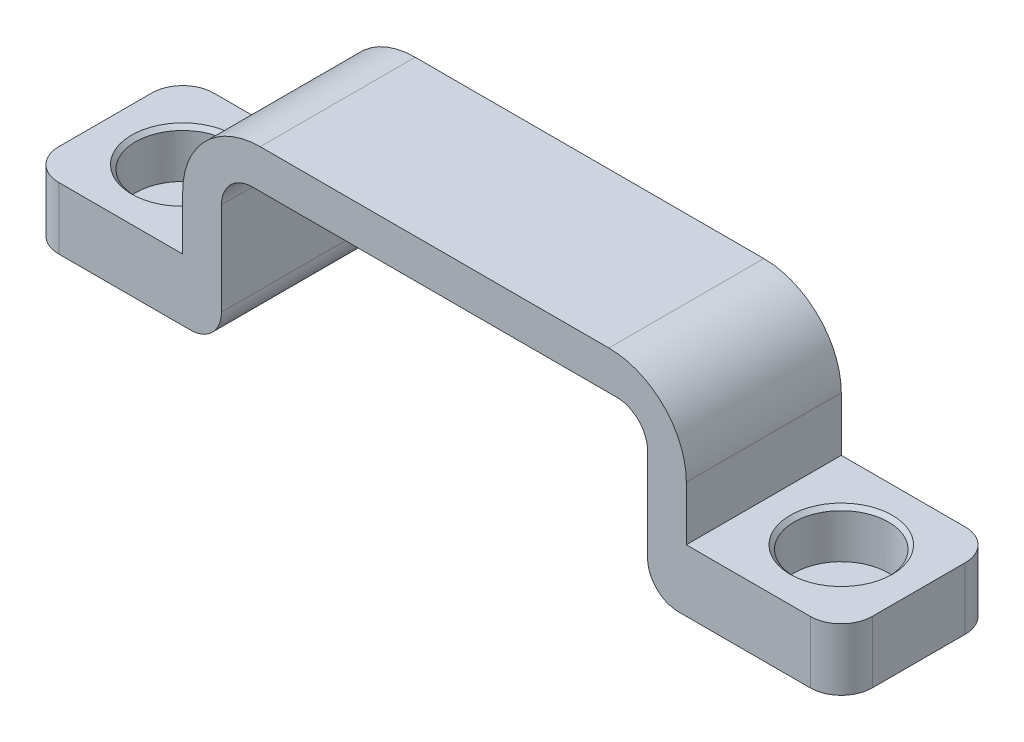
ISO-10303-21;
HEADER;
FILE_DESCRIPTION(('STEP AP214'),'2;1');
FILE_NAME('part.step','',(''),(''),'','','');
FILE_SCHEMA(('AUTOMOTIVE_DESIGN { 1 0 10303 214 1 1 1 1 }'));
ENDSEC;
DATA;
#1=APPLICATION_CONTEXT('core data for automotive mechanical design processes');
#2=APPLICATION_PROTOCOL_DEFINITION('international standard','automotive_design',2000,#1);
#3=PRODUCT_CONTEXT('',#1,'mechanical');
#4=PRODUCT('Part','Part','',(#3));
#5=PRODUCT_RELATED_PRODUCT_CATEGORY('part','',(#4));
#6=PRODUCT_DEFINITION_FORMATION('','',#4);
#7=PRODUCT_DEFINITION_CONTEXT('part definition',#1,'design');
#8=PRODUCT_DEFINITION('design','',#6,#7);
#9=PRODUCT_DEFINITION_SHAPE('','',#8);
#10=(LENGTH_UNIT() NAMED_UNIT(*) SI_UNIT(.MILLI.,.METRE.));
#11=(NAMED_UNIT(*) PLANE_ANGLE_UNIT() SI_UNIT($,.RADIAN.));
#12=(NAMED_UNIT(*) SI_UNIT($,.STERADIAN.) SOLID_ANGLE_UNIT());
#13=UNCERTAINTY_MEASURE_WITH_UNIT(LENGTH_MEASURE(1.E-05),#10,'distance_accuracy_value','');
#14=(GEOMETRIC_REPRESENTATION_CONTEXT(3) GLOBAL_UNCERTAINTY_ASSIGNED_CONTEXT((#13)) GLOBAL_UNIT_ASSIGNED_CONTEXT((#10,
#11,#12)) REPRESENTATION_CONTEXT('',''));
#15=CARTESIAN_POINT('',(0.,0.,0.));
#16=DIRECTION('',(0.,0.,1.));
#17=DIRECTION('',(1.,0.,0.));
#18=AXIS2_PLACEMENT_3D('',#15,#16,#17);
#19=CARTESIAN_POINT('',(16.25,2.5,5.));
#20=DIRECTION('',(-1.,0.,0.));
#21=DIRECTION('',(0.,0.,1.));
#22=AXIS2_PLACEMENT_3D('',#19,#20,#21);
#23=PLANE('',#22);
#24=DIRECTION('',(0.,1.,0.));
#25=VECTOR('',#24,1.);
#26=CARTESIAN_POINT('',(16.25,2.5,-5.));
#27=LINE('',#26,#25);
#28=CARTESIAN_POINT('',(16.25,-6.,-5.));
#29=VERTEX_POINT('',#28);
#30=CARTESIAN_POINT('',(16.25,-2.5,-5.));
#31=VERTEX_POINT('',#30);
#32=EDGE_CURVE('E257',#29,#31,#27,.T.);
#33=ORIENTED_EDGE('',*,*,#32,.T.);
#34=DIRECTION('',(0.,0.,-1.));
#35=VECTOR('',#34,1.);
#36=CARTESIAN_POINT('',(16.25,-2.5,5.));
#37=LINE('',#36,#35);
#38=CARTESIAN_POINT('',(16.25,-2.5,5.));
#39=VERTEX_POINT('',#38);
#40=EDGE_CURVE('E358',#31,#39,#37,.F.);
#41=ORIENTED_EDGE('',*,*,#40,.T.);
#42=DIRECTION('',(0.,1.,0.));
#43=VECTOR('',#42,1.);
#44=CARTESIAN_POINT('',(16.25,2.5,5.));
#45=LINE('',#44,#43);
#46=CARTESIAN_POINT('',(16.25,-6.,5.));
#47=VERTEX_POINT('',#46);
#48=EDGE_CURVE('E291',#47,#39,#45,.T.);
#49=ORIENTED_EDGE('',*,*,#48,.F.);
#50=DIRECTION('',(0.,0.,-1.));
#51=VECTOR('',#50,1.);
#52=CARTESIAN_POINT('',(16.25,-6.,5.));
#53=LINE('',#52,#51);
#54=EDGE_CURVE('E256',#47,#29,#53,.T.);
#55=ORIENTED_EDGE('',*,*,#54,.T.);
#56=EDGE_LOOP('',(#33,#41,#49,#55));
#57=FACE_BOUND('',#56,.T.);
#58=ADVANCED_FACE('F47',(#57),#23,.F.);
#59=CARTESIAN_POINT('',(-16.25,2.5,5.));
#60=DIRECTION('',(0.,-1.,0.));
#61=DIRECTION('',(0.,0.,-1.));
#62=AXIS2_PLACEMENT_3D('',#59,#60,#61);
#63=PLANE('',#62);
#64=DIRECTION('',(-1.,0.,0.));
#65=VECTOR('',#64,1.);
#66=CARTESIAN_POINT('',(-16.25,2.5,-5.));
#67=LINE('',#66,#65);
#68=CARTESIAN_POINT('',(11.25,2.5,-5.));
#69=VERTEX_POINT('',#68);
#70=CARTESIAN_POINT('',(-11.25,2.5,-5.));
#71=VERTEX_POINT('',#70);
#72=EDGE_CURVE('E261',#69,#71,#67,.T.);
#73=ORIENTED_EDGE('',*,*,#72,.T.);
#74=DIRECTION('',(0.,0.,-1.));
#75=VECTOR('',#74,1.);
#76=CARTESIAN_POINT('',(-11.25,2.5,5.));
#77=LINE('',#76,#75);
#78=CARTESIAN_POINT('',(-11.25,2.5,5.));
#79=VERTEX_POINT('',#78);
#80=EDGE_CURVE('E350',#71,#79,#77,.F.);
#81=ORIENTED_EDGE('',*,*,#80,.T.);
#82=DIRECTION('',(-1.,0.,0.));
#83=VECTOR('',#82,1.);
#84=CARTESIAN_POINT('',(-16.25,2.5,5.));
#85=LINE('',#84,#83);
#86=CARTESIAN_POINT('',(11.25,2.5,5.));
#87=VERTEX_POINT('',#86);
#88=EDGE_CURVE('E214',#87,#79,#85,.T.);
#89=ORIENTED_EDGE('',*,*,#88,.F.);
#90=DIRECTION('',(0.,0.,-1.));
#91=VECTOR('',#90,1.);
#92=CARTESIAN_POINT('',(11.25,2.5,5.));
#93=LINE('',#92,#91);
#94=EDGE_CURVE('E346',#87,#69,#93,.T.);
#95=ORIENTED_EDGE('',*,*,#94,.T.);
#96=EDGE_LOOP('',(#73,#81,#89,#95));
#97=FACE_BOUND('',#96,.T.);
#98=ADVANCED_FACE('F462',(#97),#63,.F.);
#99=CARTESIAN_POINT('',(-16.25,2.5,5.));
#100=DIRECTION('',(1.,0.,0.));
#101=DIRECTION('',(0.,0.,-1.));
#102=AXIS2_PLACEMENT_3D('',#99,#100,#101);
#103=PLANE('',#102);
#104=DIRECTION('',(0.,-1.,0.));
#105=VECTOR('',#104,1.);
#106=CARTESIAN_POINT('',(-16.25,2.5,5.));
#107=LINE('',#106,#105);
#108=CARTESIAN_POINT('',(-16.25,-2.5,5.));
#109=VERTEX_POINT('',#108);
#110=CARTESIAN_POINT('',(-16.25,-6.,5.));
#111=VERTEX_POINT('',#110);
#112=EDGE_CURVE('E199',#109,#111,#107,.T.);
#113=ORIENTED_EDGE('',*,*,#112,.F.);
#114=DIRECTION('',(0.,0.,-1.));
#115=VECTOR('',#114,1.);
#116=CARTESIAN_POINT('',(-16.25,-2.5,5.));
#117=LINE('',#116,#115);
#118=CARTESIAN_POINT('',(-16.25,-2.5,-5.));
#119=VERTEX_POINT('',#118);
#120=EDGE_CURVE('E337',#109,#119,#117,.T.);
#121=ORIENTED_EDGE('',*,*,#120,.T.);
#122=DIRECTION('',(0.,-1.,0.));
#123=VECTOR('',#122,1.);
#124=CARTESIAN_POINT('',(-16.25,2.5,-5.));
#125=LINE('',#124,#123);
#126=CARTESIAN_POINT('',(-16.25,-6.,-5.));
#127=VERTEX_POINT('',#126);
#128=EDGE_CURVE('E220',#119,#127,#125,.T.);
#129=ORIENTED_EDGE('',*,*,#128,.T.);
#130=DIRECTION('',(0.,0.,-1.));
#131=VECTOR('',#130,1.);
#132=CARTESIAN_POINT('',(-16.25,-6.,5.));
#133=LINE('',#132,#131);
#134=EDGE_CURVE('E217',#111,#127,#133,.T.);
#135=ORIENTED_EDGE('',*,*,#134,.F.);
#136=EDGE_LOOP('',(#113,#121,#129,#135));
#137=FACE_BOUND('',#136,.T.);
#138=ADVANCED_FACE('F218',(#137),#103,.F.);
#139=CARTESIAN_POINT('',(-16.25,-6.,5.));
#140=DIRECTION('',(0.,-1.,0.));
#141=DIRECTION('',(1.,0.,0.));
#142=AXIS2_PLACEMENT_3D('',#139,#140,#141);
#143=PLANE('',#142);
#144=CARTESIAN_POINT('',(-21.25,-6.,0.));
#145=DIRECTION('',(0.,-1.,0.));
#146=DIRECTION('',(1.,0.,0.));
#147=AXIS2_PLACEMENT_3D('',#144,#145,#146);
#148=CIRCLE('',#147,3.30000000000004);
#149=CARTESIAN_POINT('',(-17.95,-6.,0.));
#150=VERTEX_POINT('',#149);
#151=EDGE_CURVE('E441',#150,#150,#148,.T.);
#152=ORIENTED_EDGE('',*,*,#151,.T.);
#153=EDGE_LOOP('',(#152));
#154=FACE_BOUND('',#153,.T.);
#155=DIRECTION('',(-1.,0.,0.));
#156=VECTOR('',#155,1.);
#157=CARTESIAN_POINT('',(-16.25,-6.,-5.));
#158=LINE('',#157,#156);
#159=CARTESIAN_POINT('',(-24.25,-6.,-5.));
#160=VERTEX_POINT('',#159);
#161=EDGE_CURVE('E268',#127,#160,#158,.T.);
#162=ORIENTED_EDGE('',*,*,#161,.T.);
#163=CARTESIAN_POINT('',(-24.25,-6.,-3.));
#164=DIRECTION('',(0.,-1.,0.));
#165=DIRECTION('',(1.,0.,0.));
#166=AXIS2_PLACEMENT_3D('',#163,#164,#165);
#167=CIRCLE('',#166,2.);
#168=CARTESIAN_POINT('',(-26.25,-6.,-3.));
#169=VERTEX_POINT('',#168);
#170=EDGE_CURVE('E383',#160,#169,#167,.F.);
#171=ORIENTED_EDGE('',*,*,#170,.T.);
#172=DIRECTION('',(0.,0.,-1.));
#173=VECTOR('',#172,1.);
#174=CARTESIAN_POINT('',(-26.25,-6.,5.));
#175=LINE('',#174,#173);
#176=CARTESIAN_POINT('',(-26.25,-6.,3.));
#177=VERTEX_POINT('',#176);
#178=EDGE_CURVE('E226',#177,#169,#175,.T.);
#179=ORIENTED_EDGE('',*,*,#178,.F.);
#180=CARTESIAN_POINT('',(-24.25,-6.,3.));
#181=DIRECTION('',(0.,-1.,0.));
#182=DIRECTION('',(1.,0.,0.));
#183=AXIS2_PLACEMENT_3D('',#180,#181,#182);
#184=CIRCLE('',#183,2.);
#185=CARTESIAN_POINT('',(-24.25,-6.,5.));
#186=VERTEX_POINT('',#185);
#187=EDGE_CURVE('E231',#177,#186,#184,.F.);
#188=ORIENTED_EDGE('',*,*,#187,.T.);
#189=DIRECTION('',(-1.,0.,0.));
#190=VECTOR('',#189,1.);
#191=CARTESIAN_POINT('',(-16.25,-6.,5.));
#192=LINE('',#191,#190);
#193=EDGE_CURVE('E205',#111,#186,#192,.T.);
#194=ORIENTED_EDGE('',*,*,#193,.F.);
#195=ORIENTED_EDGE('',*,*,#134,.T.);
#196=EDGE_LOOP('',(#162,#171,#179,#188,#194,#195));
#197=FACE_BOUND('',#196,.T.);
#198=ADVANCED_FACE('F228',(#154,#197),#143,.F.);
#199=CARTESIAN_POINT('',(-26.25,-6.,5.));
#200=DIRECTION('',(1.,0.,0.));
#201=DIRECTION('',(0.,0.,-1.));
#202=AXIS2_PLACEMENT_3D('',#199,#200,#201);
#203=PLANE('',#202);
#204=ORIENTED_EDGE('',*,*,#178,.T.);
#205=DIRECTION('',(0.,-1.,0.));
#206=VECTOR('',#205,1.);
#207=CARTESIAN_POINT('',(-26.25,-6.,-3.));
#208=LINE('',#207,#206);
#209=CARTESIAN_POINT('',(-26.25,-10.,-3.));
#210=VERTEX_POINT('',#209);
#211=EDGE_CURVE('E364',#169,#210,#208,.T.);
#212=ORIENTED_EDGE('',*,*,#211,.T.);
#213=DIRECTION('',(0.,0.,-1.));
#214=VECTOR('',#213,1.);
#215=CARTESIAN_POINT('',(-26.25,-10.,5.));
#216=LINE('',#215,#214);
#217=CARTESIAN_POINT('',(-26.25,-10.,3.));
#218=VERTEX_POINT('',#217);
#219=EDGE_CURVE('E303',#218,#210,#216,.T.);
#220=ORIENTED_EDGE('',*,*,#219,.F.);
#221=DIRECTION('',(0.,-1.,0.));
#222=VECTOR('',#221,1.);
#223=CARTESIAN_POINT('',(-26.25,-6.,3.));
#224=LINE('',#223,#222);
#225=EDGE_CURVE('E361',#218,#177,#224,.F.);
#226=ORIENTED_EDGE('',*,*,#225,.T.);
#227=EDGE_LOOP('',(#204,#212,#220,#226));
#228=FACE_BOUND('',#227,.T.);
#229=ADVANCED_FACE('F600',(#228),#203,.F.);
#230=CARTESIAN_POINT('',(-16.25,-10.,5.));
#231=DIRECTION('',(0.,1.,0.));
#232=DIRECTION('',(-1.,0.,0.));
#233=AXIS2_PLACEMENT_3D('',#230,#231,#232);
#234=PLANE('',#233);
#235=DIRECTION('',(1.,0.,0.));
#236=VECTOR('',#235,1.);
#237=CARTESIAN_POINT('',(-16.25,-10.,-5.));
#238=LINE('',#237,#236);
#239=CARTESIAN_POINT('',(-24.25,-9.99999999999999,-5.));
#240=VERTEX_POINT('',#239);
#241=CARTESIAN_POINT('',(-15.75,-10.,-5.));
#242=VERTEX_POINT('',#241);
#243=EDGE_CURVE('E271',#240,#242,#238,.T.);
#244=ORIENTED_EDGE('',*,*,#243,.T.);
#245=DIRECTION('',(0.,0.,-1.));
#246=VECTOR('',#245,1.);
#247=CARTESIAN_POINT('',(-15.75,-10.,5.));
#248=LINE('',#247,#246);
#249=CARTESIAN_POINT('',(-15.75,-10.,5.));
#250=VERTEX_POINT('',#249);
#251=EDGE_CURVE('E423',#242,#250,#248,.F.);
#252=ORIENTED_EDGE('',*,*,#251,.T.);
#253=DIRECTION('',(1.,0.,0.));
#254=VECTOR('',#253,1.);
#255=CARTESIAN_POINT('',(-16.25,-10.,5.));
#256=LINE('',#255,#254);
#257=CARTESIAN_POINT('',(-24.25,-10.,5.));
#258=VERTEX_POINT('',#257);
#259=EDGE_CURVE('E233',#258,#250,#256,.T.);
#260=ORIENTED_EDGE('',*,*,#259,.F.);
#261=CARTESIAN_POINT('',(-24.25,-9.99999999999999,3.));
#262=DIRECTION('',(0.,1.,0.));
#263=DIRECTION('',(-1.,0.,0.));
#264=AXIS2_PLACEMENT_3D('',#261,#262,#263);
#265=CIRCLE('',#264,2.);
#266=EDGE_CURVE('E368',#258,#218,#265,.F.);
#267=ORIENTED_EDGE('',*,*,#266,.T.);
#268=ORIENTED_EDGE('',*,*,#219,.T.);
#269=CARTESIAN_POINT('',(-24.25,-9.99999999999999,-3.));
#270=DIRECTION('',(0.,1.,0.));
#271=DIRECTION('',(-1.,0.,0.));
#272=AXIS2_PLACEMENT_3D('',#269,#270,#271);
#273=CIRCLE('',#272,2.);
#274=EDGE_CURVE('E371',#210,#240,#273,.F.);
#275=ORIENTED_EDGE('',*,*,#274,.T.);
#276=EDGE_LOOP('',(#244,#252,#260,#267,#268,#275));
#277=FACE_BOUND('',#276,.T.);
#278=ADVANCED_FACE('F596',(#277),#234,.F.);
#279=CARTESIAN_POINT('',(-13.75,-10.,5.));
#280=DIRECTION('',(-1.,0.,0.));
#281=DIRECTION('',(0.,0.,1.));
#282=AXIS2_PLACEMENT_3D('',#279,#280,#281);
#283=PLANE('',#282);
#284=DIRECTION('',(0.,1.,0.));
#285=VECTOR('',#284,1.);
#286=CARTESIAN_POINT('',(-13.75,-10.,5.));
#287=LINE('',#286,#285);
#288=CARTESIAN_POINT('',(-13.75,-8.,5.));
#289=VERTEX_POINT('',#288);
#290=CARTESIAN_POINT('',(-13.75,-2.,5.));
#291=VERTEX_POINT('',#290);
#292=EDGE_CURVE('E237',#289,#291,#287,.T.);
#293=ORIENTED_EDGE('',*,*,#292,.F.);
#294=DIRECTION('',(0.,0.,-1.));
#295=VECTOR('',#294,1.);
#296=CARTESIAN_POINT('',(-13.75,-8.,5.));
#297=LINE('',#296,#295);
#298=CARTESIAN_POINT('',(-13.75,-8.,-5.));
#299=VERTEX_POINT('',#298);
#300=EDGE_CURVE('E413',#289,#299,#297,.T.);
#301=ORIENTED_EDGE('',*,*,#300,.T.);
#302=DIRECTION('',(0.,1.,0.));
#303=VECTOR('',#302,1.);
#304=CARTESIAN_POINT('',(-13.75,-10.,-5.));
#305=LINE('',#304,#303);
#306=CARTESIAN_POINT('',(-13.75,-2.,-5.));
#307=VERTEX_POINT('',#306);
#308=EDGE_CURVE('E275',#299,#307,#305,.T.);
#309=ORIENTED_EDGE('',*,*,#308,.T.);
#310=DIRECTION('',(0.,0.,-1.));
#311=VECTOR('',#310,1.);
#312=CARTESIAN_POINT('',(-13.75,-2.,5.));
#313=LINE('',#312,#311);
#314=EDGE_CURVE('E316',#307,#291,#313,.F.);
#315=ORIENTED_EDGE('',*,*,#314,.T.);
#316=EDGE_LOOP('',(#293,#301,#309,#315));
#317=FACE_BOUND('',#316,.T.);
#318=ADVANCED_FACE('F592',(#317),#283,.F.);
#319=CARTESIAN_POINT('',(-13.75,0.,5.));
#320=DIRECTION('',(0.,1.,0.));
#321=DIRECTION('',(0.,0.,1.));
#322=AXIS2_PLACEMENT_3D('',#319,#320,#321);
#323=PLANE('',#322);
#324=DIRECTION('',(1.,0.,0.));
#325=VECTOR('',#324,1.);
#326=CARTESIAN_POINT('',(-13.75,0.,5.));
#327=LINE('',#326,#325);
#328=CARTESIAN_POINT('',(-11.75,0.,5.));
#329=VERTEX_POINT('',#328);
#330=CARTESIAN_POINT('',(11.75,0.,5.));
#331=VERTEX_POINT('',#330);
#332=EDGE_CURVE('E243',#329,#331,#327,.T.);
#333=ORIENTED_EDGE('',*,*,#332,.F.);
#334=DIRECTION('',(0.,0.,-1.));
#335=VECTOR('',#334,1.);
#336=CARTESIAN_POINT('',(-11.75,0.,-5.));
#337=LINE('',#336,#335);
#338=CARTESIAN_POINT('',(-11.75,0.,-5.));
#339=VERTEX_POINT('',#338);
#340=EDGE_CURVE('E312',#329,#339,#337,.T.);
#341=ORIENTED_EDGE('',*,*,#340,.T.);
#342=DIRECTION('',(1.,0.,0.));
#343=VECTOR('',#342,1.);
#344=CARTESIAN_POINT('',(-13.75,0.,-5.));
#345=LINE('',#344,#343);
#346=CARTESIAN_POINT('',(11.75,0.,-5.));
#347=VERTEX_POINT('',#346);
#348=EDGE_CURVE('E278',#339,#347,#345,.T.);
#349=ORIENTED_EDGE('',*,*,#348,.T.);
#350=DIRECTION('',(0.,0.,-1.));
#351=VECTOR('',#350,1.);
#352=CARTESIAN_POINT('',(11.75,0.,5.));
#353=LINE('',#352,#351);
#354=EDGE_CURVE('E225',#347,#331,#353,.F.);
#355=ORIENTED_EDGE('',*,*,#354,.T.);
#356=EDGE_LOOP('',(#333,#341,#349,#355));
#357=FACE_BOUND('',#356,.T.);
#358=ADVANCED_FACE('F589',(#357),#323,.F.);
#359=CARTESIAN_POINT('',(13.75,-10.,5.));
#360=DIRECTION('',(1.,0.,0.));
#361=DIRECTION('',(0.,0.,-1.));
#362=AXIS2_PLACEMENT_3D('',#359,#360,#361);
#363=PLANE('',#362);
#364=DIRECTION('',(0.,-1.,0.));
#365=VECTOR('',#364,1.);
#366=CARTESIAN_POINT('',(13.75,-10.,-5.));
#367=LINE('',#366,#365);
#368=CARTESIAN_POINT('',(13.75,-2.,-5.));
#369=VERTEX_POINT('',#368);
#370=CARTESIAN_POINT('',(13.75,-8.,-5.));
#371=VERTEX_POINT('',#370);
#372=EDGE_CURVE('E282',#369,#371,#367,.T.);
#373=ORIENTED_EDGE('',*,*,#372,.T.);
#374=DIRECTION('',(0.,0.,-1.));
#375=VECTOR('',#374,1.);
#376=CARTESIAN_POINT('',(13.75,-8.,5.));
#377=LINE('',#376,#375);
#378=CARTESIAN_POINT('',(13.75,-8.,5.));
#379=VERTEX_POINT('',#378);
#380=EDGE_CURVE('E72',#371,#379,#377,.F.);
#381=ORIENTED_EDGE('',*,*,#380,.T.);
#382=DIRECTION('',(0.,-1.,0.));
#383=VECTOR('',#382,1.);
#384=CARTESIAN_POINT('',(13.75,-10.,5.));
#385=LINE('',#384,#383);
#386=CARTESIAN_POINT('',(13.75,-2.,5.));
#387=VERTEX_POINT('',#386);
#388=EDGE_CURVE('E247',#387,#379,#385,.T.);
#389=ORIENTED_EDGE('',*,*,#388,.F.);
#390=DIRECTION('',(0.,0.,-1.));
#391=VECTOR('',#390,1.);
#392=CARTESIAN_POINT('',(13.75,-2.,-5.));
#393=LINE('',#392,#391);
#394=EDGE_CURVE('E320',#387,#369,#393,.T.);
#395=ORIENTED_EDGE('',*,*,#394,.T.);
#396=EDGE_LOOP('',(#373,#381,#389,#395));
#397=FACE_BOUND('',#396,.T.);
#398=ADVANCED_FACE('F586',(#397),#363,.F.);
#399=CARTESIAN_POINT('',(16.25,-10.,5.));
#400=DIRECTION('',(0.,1.,0.));
#401=DIRECTION('',(-1.,0.,0.));
#402=AXIS2_PLACEMENT_3D('',#399,#400,#401);
#403=PLANE('',#402);
#404=DIRECTION('',(1.,0.,0.));
#405=VECTOR('',#404,1.);
#406=CARTESIAN_POINT('',(16.25,-10.,5.));
#407=LINE('',#406,#405);
#408=CARTESIAN_POINT('',(15.75,-10.,5.));
#409=VERTEX_POINT('',#408);
#410=CARTESIAN_POINT('',(24.25,-9.99999999999999,5.));
#411=VERTEX_POINT('',#410);
#412=EDGE_CURVE('E250',#409,#411,#407,.T.);
#413=ORIENTED_EDGE('',*,*,#412,.F.);
#414=DIRECTION('',(0.,0.,-1.));
#415=VECTOR('',#414,1.);
#416=CARTESIAN_POINT('',(15.75,-10.,5.));
#417=LINE('',#416,#415);
#418=CARTESIAN_POINT('',(15.75,-10.,-5.));
#419=VERTEX_POINT('',#418);
#420=EDGE_CURVE('E431',#409,#419,#417,.T.);
#421=ORIENTED_EDGE('',*,*,#420,.T.);
#422=DIRECTION('',(1.,0.,0.));
#423=VECTOR('',#422,1.);
#424=CARTESIAN_POINT('',(16.25,-10.,-5.));
#425=LINE('',#424,#423);
#426=CARTESIAN_POINT('',(24.25,-10.,-5.));
#427=VERTEX_POINT('',#426);
#428=EDGE_CURVE('E285',#419,#427,#425,.T.);
#429=ORIENTED_EDGE('',*,*,#428,.T.);
#430=CARTESIAN_POINT('',(24.25,-10.,-3.));
#431=DIRECTION('',(0.,1.,0.));
#432=DIRECTION('',(-1.,0.,0.));
#433=AXIS2_PLACEMENT_3D('',#430,#431,#432);
#434=CIRCLE('',#433,2.);
#435=CARTESIAN_POINT('',(26.25,-10.,-3.));
#436=VERTEX_POINT('',#435);
#437=EDGE_CURVE('E410',#427,#436,#434,.F.);
#438=ORIENTED_EDGE('',*,*,#437,.T.);
#439=DIRECTION('',(0.,0.,-1.));
#440=VECTOR('',#439,1.);
#441=CARTESIAN_POINT('',(26.25,-10.,5.));
#442=LINE('',#441,#440);
#443=CARTESIAN_POINT('',(26.25,-10.,3.));
#444=VERTEX_POINT('',#443);
#445=EDGE_CURVE('E299',#444,#436,#442,.T.);
#446=ORIENTED_EDGE('',*,*,#445,.F.);
#447=CARTESIAN_POINT('',(24.25,-10.,3.));
#448=DIRECTION('',(0.,1.,0.));
#449=DIRECTION('',(-1.,0.,0.));
#450=AXIS2_PLACEMENT_3D('',#447,#448,#449);
#451=CIRCLE('',#450,2.);
#452=EDGE_CURVE('E406',#444,#411,#451,.F.);
#453=ORIENTED_EDGE('',*,*,#452,.T.);
#454=EDGE_LOOP('',(#413,#421,#429,#438,#446,#453));
#455=FACE_BOUND('',#454,.T.);
#456=ADVANCED_FACE('F526',(#455),#403,.F.);
#457=CARTESIAN_POINT('',(26.25,-6.,5.));
#458=DIRECTION('',(-1.,0.,0.));
#459=DIRECTION('',(0.,0.,1.));
#460=AXIS2_PLACEMENT_3D('',#457,#458,#459);
#461=PLANE('',#460);
#462=ORIENTED_EDGE('',*,*,#445,.T.);
#463=DIRECTION('',(0.,1.,0.));
#464=VECTOR('',#463,1.);
#465=CARTESIAN_POINT('',(26.25,-6.,-3.));
#466=LINE('',#465,#464);
#467=CARTESIAN_POINT('',(26.25,-6.,-3.));
#468=VERTEX_POINT('',#467);
#469=EDGE_CURVE('E396',#436,#468,#466,.T.);
#470=ORIENTED_EDGE('',*,*,#469,.T.);
#471=DIRECTION('',(0.,0.,-1.));
#472=VECTOR('',#471,1.);
#473=CARTESIAN_POINT('',(26.25,-6.,5.));
#474=LINE('',#473,#472);
#475=CARTESIAN_POINT('',(26.25,-6.,3.));
#476=VERTEX_POINT('',#475);
#477=EDGE_CURVE('E295',#476,#468,#474,.T.);
#478=ORIENTED_EDGE('',*,*,#477,.F.);
#479=DIRECTION('',(0.,1.,0.));
#480=VECTOR('',#479,1.);
#481=CARTESIAN_POINT('',(26.25,-10.,3.));
#482=LINE('',#481,#480);
#483=EDGE_CURVE('E393',#476,#444,#482,.F.);
#484=ORIENTED_EDGE('',*,*,#483,.T.);
#485=EDGE_LOOP('',(#462,#470,#478,#484));
#486=FACE_BOUND('',#485,.T.);
#487=ADVANCED_FACE('F538',(#486),#461,.F.);
#488=CARTESIAN_POINT('',(16.25,-6.,5.));
#489=DIRECTION('',(0.,-1.,0.));
#490=DIRECTION('',(1.,0.,0.));
#491=AXIS2_PLACEMENT_3D('',#488,#489,#490);
#492=PLANE('',#491);
#493=CARTESIAN_POINT('',(21.25,-6.,0.));
#494=DIRECTION('',(0.,-1.,0.));
#495=DIRECTION('',(1.,0.,0.));
#496=AXIS2_PLACEMENT_3D('',#493,#494,#495);
#497=CIRCLE('',#496,3.30000000000003);
#498=CARTESIAN_POINT('',(24.55,-6.,0.));
#499=VERTEX_POINT('',#498);
#500=EDGE_CURVE('E12',#499,#499,#497,.T.);
#501=ORIENTED_EDGE('',*,*,#500,.T.);
#502=EDGE_LOOP('',(#501));
#503=FACE_BOUND('',#502,.T.);
#504=ORIENTED_EDGE('',*,*,#477,.T.);
#505=CARTESIAN_POINT('',(24.25,-6.,-3.));
#506=DIRECTION('',(0.,-1.,0.));
#507=DIRECTION('',(1.,0.,0.));
#508=AXIS2_PLACEMENT_3D('',#505,#506,#507);
#509=CIRCLE('',#508,2.);
#510=CARTESIAN_POINT('',(24.25,-6.,-5.));
#511=VERTEX_POINT('',#510);
#512=EDGE_CURVE('E403',#468,#511,#509,.F.);
#513=ORIENTED_EDGE('',*,*,#512,.T.);
#514=DIRECTION('',(-1.,0.,0.));
#515=VECTOR('',#514,1.);
#516=CARTESIAN_POINT('',(16.25,-6.,-5.));
#517=LINE('',#516,#515);
#518=EDGE_CURVE('E288',#511,#29,#517,.T.);
#519=ORIENTED_EDGE('',*,*,#518,.T.);
#520=ORIENTED_EDGE('',*,*,#54,.F.);
#521=DIRECTION('',(-1.,0.,0.));
#522=VECTOR('',#521,1.);
#523=CARTESIAN_POINT('',(16.25,-6.,5.));
#524=LINE('',#523,#522);
#525=CARTESIAN_POINT('',(24.25,-6.,5.));
#526=VERTEX_POINT('',#525);
#527=EDGE_CURVE('E253',#526,#47,#524,.T.);
#528=ORIENTED_EDGE('',*,*,#527,.F.);
#529=CARTESIAN_POINT('',(24.25,-6.,3.));
#530=DIRECTION('',(0.,-1.,0.));
#531=DIRECTION('',(1.,0.,0.));
#532=AXIS2_PLACEMENT_3D('',#529,#530,#531);
#533=CIRCLE('',#532,2.);
#534=EDGE_CURVE('E400',#526,#476,#533,.F.);
#535=ORIENTED_EDGE('',*,*,#534,.T.);
#536=EDGE_LOOP('',(#504,#513,#519,#520,#528,#535));
#537=FACE_BOUND('',#536,.T.);
#538=ADVANCED_FACE('F546',(#503,#537),#492,.F.);
#539=CARTESIAN_POINT('',(0.,0.,5.));
#540=DIRECTION('',(0.,0.,1.));
#541=DIRECTION('',(1.,0.,0.));
#542=AXIS2_PLACEMENT_3D('',#539,#540,#541);
#543=PLANE('',#542);
#544=ORIENTED_EDGE('',*,*,#259,.T.);
#545=CARTESIAN_POINT('',(-15.75,-8.,5.));
#546=DIRECTION('',(0.,0.,1.));
#547=DIRECTION('',(1.,0.,0.));
#548=AXIS2_PLACEMENT_3D('',#545,#546,#547);
#549=CIRCLE('',#548,2.);
#550=EDGE_CURVE('E428',#250,#289,#549,.T.);
#551=ORIENTED_EDGE('',*,*,#550,.T.);
#552=ORIENTED_EDGE('',*,*,#292,.T.);
#553=CARTESIAN_POINT('',(-11.75,-2.,5.));
#554=DIRECTION('',(0.,0.,1.));
#555=DIRECTION('',(1.,0.,0.));
#556=AXIS2_PLACEMENT_3D('',#553,#554,#555);
#557=CIRCLE('',#556,2.);
#558=EDGE_CURVE('E328',#291,#329,#557,.F.);
#559=ORIENTED_EDGE('',*,*,#558,.T.);
#560=ORIENTED_EDGE('',*,*,#332,.T.);
#561=CARTESIAN_POINT('',(11.75,-2.,5.));
#562=DIRECTION('',(0.,0.,1.));
#563=DIRECTION('',(1.,0.,0.));
#564=AXIS2_PLACEMENT_3D('',#561,#562,#563);
#565=CIRCLE('',#564,2.);
#566=EDGE_CURVE('E334',#331,#387,#565,.F.);
#567=ORIENTED_EDGE('',*,*,#566,.T.);
#568=ORIENTED_EDGE('',*,*,#388,.T.);
#569=CARTESIAN_POINT('',(15.75,-8.,5.));
#570=DIRECTION('',(0.,0.,1.));
#571=DIRECTION('',(1.,0.,0.));
#572=AXIS2_PLACEMENT_3D('',#569,#570,#571);
#573=CIRCLE('',#572,2.);
#574=EDGE_CURVE('E64',#379,#409,#573,.T.);
#575=ORIENTED_EDGE('',*,*,#574,.T.);
#576=ORIENTED_EDGE('',*,*,#412,.T.);
#577=DIRECTION('',(0.,1.,0.));
#578=VECTOR('',#577,1.);
#579=CARTESIAN_POINT('',(24.25,-6.,5.));
#580=LINE('',#579,#578);
#581=EDGE_CURVE('E386',#411,#526,#580,.T.);
#582=ORIENTED_EDGE('',*,*,#581,.T.);
#583=ORIENTED_EDGE('',*,*,#527,.T.);
#584=ORIENTED_EDGE('',*,*,#48,.T.);
#585=CARTESIAN_POINT('',(11.25,-2.5,5.));
#586=DIRECTION('',(0.,0.,1.));
#587=DIRECTION('',(1.,0.,0.));
#588=AXIS2_PLACEMENT_3D('',#585,#586,#587);
#589=CIRCLE('',#588,5.);
#590=EDGE_CURVE('E353',#39,#87,#589,.T.);
#591=ORIENTED_EDGE('',*,*,#590,.T.);
#592=ORIENTED_EDGE('',*,*,#88,.T.);
#593=CARTESIAN_POINT('',(-11.25,-2.5,5.));
#594=DIRECTION('',(0.,0.,1.));
#595=DIRECTION('',(1.,0.,0.));
#596=AXIS2_PLACEMENT_3D('',#593,#594,#595);
#597=CIRCLE('',#596,5.);
#598=EDGE_CURVE('E209',#79,#109,#597,.T.);
#599=ORIENTED_EDGE('',*,*,#598,.T.);
#600=ORIENTED_EDGE('',*,*,#112,.T.);
#601=ORIENTED_EDGE('',*,*,#193,.T.);
#602=DIRECTION('',(0.,-1.,0.));
#603=VECTOR('',#602,1.);
#604=CARTESIAN_POINT('',(-24.25,-10.,5.));
#605=LINE('',#604,#603);
#606=EDGE_CURVE('E390',#186,#258,#605,.T.);
#607=ORIENTED_EDGE('',*,*,#606,.T.);
#608=EDGE_LOOP('',(#544,#551,#552,#559,#560,#567,#568,#575,#576,#582,#583,#584,#591,#592,#599,
#600,#601,#607));
#609=FACE_BOUND('',#608,.T.);
#610=ADVANCED_FACE('F202',(#609),#543,.T.);
#611=CARTESIAN_POINT('',(0.,0.,-5.));
#612=DIRECTION('',(0.,0.,1.));
#613=DIRECTION('',(1.,0.,0.));
#614=AXIS2_PLACEMENT_3D('',#611,#612,#613);
#615=PLANE('',#614);
#616=ORIENTED_EDGE('',*,*,#308,.F.);
#617=CARTESIAN_POINT('',(-15.75,-8.,-5.));
#618=DIRECTION('',(0.,0.,1.));
#619=DIRECTION('',(1.,0.,0.));
#620=AXIS2_PLACEMENT_3D('',#617,#618,#619);
#621=CIRCLE('',#620,2.);
#622=EDGE_CURVE('E420',#299,#242,#621,.F.);
#623=ORIENTED_EDGE('',*,*,#622,.T.);
#624=ORIENTED_EDGE('',*,*,#243,.F.);
#625=DIRECTION('',(0.,-1.,0.));
#626=VECTOR('',#625,1.);
#627=CARTESIAN_POINT('',(-24.25,0.,-5.));
#628=LINE('',#627,#626);
#629=EDGE_CURVE('E378',#240,#160,#628,.F.);
#630=ORIENTED_EDGE('',*,*,#629,.T.);
#631=ORIENTED_EDGE('',*,*,#161,.F.);
#632=ORIENTED_EDGE('',*,*,#128,.F.);
#633=CARTESIAN_POINT('',(-11.25,-2.5,-5.));
#634=DIRECTION('',(0.,0.,1.));
#635=DIRECTION('',(1.,0.,0.));
#636=AXIS2_PLACEMENT_3D('',#633,#634,#635);
#637=CIRCLE('',#636,5.);
#638=EDGE_CURVE('E343',#119,#71,#637,.F.);
#639=ORIENTED_EDGE('',*,*,#638,.T.);
#640=ORIENTED_EDGE('',*,*,#72,.F.);
#641=CARTESIAN_POINT('',(11.25,-2.5,-5.));
#642=DIRECTION('',(0.,0.,1.));
#643=DIRECTION('',(1.,0.,0.));
#644=AXIS2_PLACEMENT_3D('',#641,#642,#643);
#645=CIRCLE('',#644,5.);
#646=EDGE_CURVE('E340',#69,#31,#645,.F.);
#647=ORIENTED_EDGE('',*,*,#646,.T.);
#648=ORIENTED_EDGE('',*,*,#32,.F.);
#649=ORIENTED_EDGE('',*,*,#518,.F.);
#650=DIRECTION('',(0.,1.,0.));
#651=VECTOR('',#650,1.);
#652=CARTESIAN_POINT('',(24.25,0.,-5.));
#653=LINE('',#652,#651);
#654=EDGE_CURVE('E374',#511,#427,#653,.F.);
#655=ORIENTED_EDGE('',*,*,#654,.T.);
#656=ORIENTED_EDGE('',*,*,#428,.F.);
#657=CARTESIAN_POINT('',(15.75,-8.,-5.));
#658=DIRECTION('',(0.,0.,1.));
#659=DIRECTION('',(1.,0.,0.));
#660=AXIS2_PLACEMENT_3D('',#657,#658,#659);
#661=CIRCLE('',#660,2.);
#662=EDGE_CURVE('E417',#419,#371,#661,.F.);
#663=ORIENTED_EDGE('',*,*,#662,.T.);
#664=ORIENTED_EDGE('',*,*,#372,.F.);
#665=CARTESIAN_POINT('',(11.75,-2.,-5.));
#666=DIRECTION('',(0.,0.,1.));
#667=DIRECTION('',(1.,0.,0.));
#668=AXIS2_PLACEMENT_3D('',#665,#666,#667);
#669=CIRCLE('',#668,2.);
#670=EDGE_CURVE('E331',#369,#347,#669,.T.);
#671=ORIENTED_EDGE('',*,*,#670,.T.);
#672=ORIENTED_EDGE('',*,*,#348,.F.);
#673=CARTESIAN_POINT('',(-11.75,-2.,-5.));
#674=DIRECTION('',(0.,0.,1.));
#675=DIRECTION('',(1.,0.,0.));
#676=AXIS2_PLACEMENT_3D('',#673,#674,#675);
#677=CIRCLE('',#676,2.);
#678=EDGE_CURVE('E324',#339,#307,#677,.T.);
#679=ORIENTED_EDGE('',*,*,#678,.T.);
#680=EDGE_LOOP('',(#616,#623,#624,#630,#631,#632,#639,#640,#647,#648,#649,#655,#656,#663,#664,
#671,#672,#679));
#681=FACE_BOUND('',#680,.T.);
#682=ADVANCED_FACE('F477',(#681),#615,.F.);
#683=CARTESIAN_POINT('',(-11.75,-2.,5.));
#684=DIRECTION('',(0.,0.,1.));
#685=DIRECTION('',(1.,0.,0.));
#686=AXIS2_PLACEMENT_3D('',#683,#684,#685);
#687=CYLINDRICAL_SURFACE('',#686,2.);
#688=ORIENTED_EDGE('',*,*,#558,.F.);
#689=ORIENTED_EDGE('',*,*,#314,.F.);
#690=ORIENTED_EDGE('',*,*,#678,.F.);
#691=ORIENTED_EDGE('',*,*,#340,.F.);
#692=EDGE_LOOP('',(#688,#689,#690,#691));
#693=FACE_BOUND('',#692,.T.);
#694=ADVANCED_FACE('F473',(#693),#687,.F.);
#695=CARTESIAN_POINT('',(11.75,-2.,5.));
#696=DIRECTION('',(0.,0.,1.));
#697=DIRECTION('',(1.,0.,0.));
#698=AXIS2_PLACEMENT_3D('',#695,#696,#697);
#699=CYLINDRICAL_SURFACE('',#698,2.);
#700=ORIENTED_EDGE('',*,*,#566,.F.);
#701=ORIENTED_EDGE('',*,*,#354,.F.);
#702=ORIENTED_EDGE('',*,*,#670,.F.);
#703=ORIENTED_EDGE('',*,*,#394,.F.);
#704=EDGE_LOOP('',(#700,#701,#702,#703));
#705=FACE_BOUND('',#704,.T.);
#706=ADVANCED_FACE('F476',(#705),#699,.F.);
#707=CARTESIAN_POINT('',(-11.25,-2.5,5.));
#708=DIRECTION('',(0.,0.,-1.));
#709=DIRECTION('',(-1.,0.,0.));
#710=AXIS2_PLACEMENT_3D('',#707,#708,#709);
#711=CYLINDRICAL_SURFACE('',#710,5.);
#712=ORIENTED_EDGE('',*,*,#598,.F.);
#713=ORIENTED_EDGE('',*,*,#80,.F.);
#714=ORIENTED_EDGE('',*,*,#638,.F.);
#715=ORIENTED_EDGE('',*,*,#120,.F.);
#716=EDGE_LOOP('',(#712,#713,#714,#715));
#717=FACE_BOUND('',#716,.T.);
#718=ADVANCED_FACE('F480',(#717),#711,.T.);
#719=CARTESIAN_POINT('',(11.25,-2.5,5.));
#720=DIRECTION('',(0.,0.,-1.));
#721=DIRECTION('',(-1.,0.,0.));
#722=AXIS2_PLACEMENT_3D('',#719,#720,#721);
#723=CYLINDRICAL_SURFACE('',#722,5.);
#724=ORIENTED_EDGE('',*,*,#590,.F.);
#725=ORIENTED_EDGE('',*,*,#40,.F.);
#726=ORIENTED_EDGE('',*,*,#646,.F.);
#727=ORIENTED_EDGE('',*,*,#94,.F.);
#728=EDGE_LOOP('',(#724,#725,#726,#727));
#729=FACE_BOUND('',#728,.T.);
#730=ADVANCED_FACE('F484',(#729),#723,.T.);
#731=CARTESIAN_POINT('',(-24.25,-6.,-3.));
#732=DIRECTION('',(0.,-1.,0.));
#733=DIRECTION('',(0.,0.,-1.));
#734=AXIS2_PLACEMENT_3D('',#731,#732,#733);
#735=CYLINDRICAL_SURFACE('',#734,2.);
#736=ORIENTED_EDGE('',*,*,#170,.F.);
#737=ORIENTED_EDGE('',*,*,#629,.F.);
#738=ORIENTED_EDGE('',*,*,#274,.F.);
#739=ORIENTED_EDGE('',*,*,#211,.F.);
#740=EDGE_LOOP('',(#736,#737,#738,#739));
#741=FACE_BOUND('',#740,.T.);
#742=ADVANCED_FACE('F488',(#741),#735,.T.);
#743=CARTESIAN_POINT('',(-24.25,0.,3.));
#744=DIRECTION('',(0.,1.,0.));
#745=DIRECTION('',(0.,0.,1.));
#746=AXIS2_PLACEMENT_3D('',#743,#744,#745);
#747=CYLINDRICAL_SURFACE('',#746,2.);
#748=ORIENTED_EDGE('',*,*,#187,.F.);
#749=ORIENTED_EDGE('',*,*,#225,.F.);
#750=ORIENTED_EDGE('',*,*,#266,.F.);
#751=ORIENTED_EDGE('',*,*,#606,.F.);
#752=EDGE_LOOP('',(#748,#749,#750,#751));
#753=FACE_BOUND('',#752,.T.);
#754=ADVANCED_FACE('F492',(#753),#747,.T.);
#755=CARTESIAN_POINT('',(24.25,-6.,-3.));
#756=DIRECTION('',(0.,1.,0.));
#757=DIRECTION('',(0.,0.,1.));
#758=AXIS2_PLACEMENT_3D('',#755,#756,#757);
#759=CYLINDRICAL_SURFACE('',#758,2.);
#760=ORIENTED_EDGE('',*,*,#437,.F.);
#761=ORIENTED_EDGE('',*,*,#654,.F.);
#762=ORIENTED_EDGE('',*,*,#512,.F.);
#763=ORIENTED_EDGE('',*,*,#469,.F.);
#764=EDGE_LOOP('',(#760,#761,#762,#763));
#765=FACE_BOUND('',#764,.T.);
#766=ADVANCED_FACE('F496',(#765),#759,.T.);
#767=CARTESIAN_POINT('',(24.25,0.,3.));
#768=DIRECTION('',(0.,-1.,0.));
#769=DIRECTION('',(0.,0.,-1.));
#770=AXIS2_PLACEMENT_3D('',#767,#768,#769);
#771=CYLINDRICAL_SURFACE('',#770,2.);
#772=ORIENTED_EDGE('',*,*,#452,.F.);
#773=ORIENTED_EDGE('',*,*,#483,.F.);
#774=ORIENTED_EDGE('',*,*,#534,.F.);
#775=ORIENTED_EDGE('',*,*,#581,.F.);
#776=EDGE_LOOP('',(#772,#773,#774,#775));
#777=FACE_BOUND('',#776,.T.);
#778=ADVANCED_FACE('F500',(#777),#771,.T.);
#779=CARTESIAN_POINT('',(-15.75,-8.,5.));
#780=DIRECTION('',(0.,0.,-1.));
#781=DIRECTION('',(-1.,0.,0.));
#782=AXIS2_PLACEMENT_3D('',#779,#780,#781);
#783=CYLINDRICAL_SURFACE('',#782,2.);
#784=ORIENTED_EDGE('',*,*,#550,.F.);
#785=ORIENTED_EDGE('',*,*,#251,.F.);
#786=ORIENTED_EDGE('',*,*,#622,.F.);
#787=ORIENTED_EDGE('',*,*,#300,.F.);
#788=EDGE_LOOP('',(#784,#785,#786,#787));
#789=FACE_BOUND('',#788,.T.);
#790=ADVANCED_FACE('F504',(#789),#783,.T.);
#791=CARTESIAN_POINT('',(15.75,-8.,5.));
#792=DIRECTION('',(0.,0.,-1.));
#793=DIRECTION('',(-1.,0.,0.));
#794=AXIS2_PLACEMENT_3D('',#791,#792,#793);
#795=CYLINDRICAL_SURFACE('',#794,2.);
#796=ORIENTED_EDGE('',*,*,#574,.F.);
#797=ORIENTED_EDGE('',*,*,#380,.F.);
#798=ORIENTED_EDGE('',*,*,#662,.F.);
#799=ORIENTED_EDGE('',*,*,#420,.F.);
#800=EDGE_LOOP('',(#796,#797,#798,#799));
#801=FACE_BOUND('',#800,.T.);
#802=ADVANCED_FACE('F508',(#801),#795,.T.);
#803=CARTESIAN_POINT('',(21.25,-9.1,0.));
#804=DIRECTION('',(0.,1.,0.));
#805=DIRECTION('',(-1.,0.,0.));
#806=AXIS2_PLACEMENT_3D('',#803,#804,#805);
#807=CYLINDRICAL_SURFACE('',#806,3.05);
#808=CARTESIAN_POINT('',(21.25,-6.25000000000002,0.));
#809=DIRECTION('',(0.,-1.,0.));
#810=DIRECTION('',(0.,0.,-1.));
#811=AXIS2_PLACEMENT_3D('',#808,#809,#810);
#812=CIRCLE('',#811,3.05);
#813=CARTESIAN_POINT('',(21.25,-6.25000000000002,-3.05));
#814=VERTEX_POINT('',#813);
#815=EDGE_CURVE('E57',#814,#814,#812,.F.);
#816=ORIENTED_EDGE('',*,*,#815,.T.);
#817=EDGE_LOOP('',(#816));
#818=FACE_BOUND('',#817,.T.);
#819=CARTESIAN_POINT('',(21.25,-9.1,0.));
#820=DIRECTION('',(0.,1.,0.));
#821=DIRECTION('',(-1.,0.,0.));
#822=AXIS2_PLACEMENT_3D('',#819,#820,#821);
#823=CIRCLE('',#822,3.05);
#824=CARTESIAN_POINT('',(18.2,-9.1,0.));
#825=VERTEX_POINT('',#824);
#826=EDGE_CURVE('E262',#825,#825,#823,.T.);
#827=ORIENTED_EDGE('',*,*,#826,.F.);
#828=EDGE_LOOP('',(#827));
#829=FACE_BOUND('',#828,.T.);
#830=ADVANCED_FACE('F449',(#818,#829),#807,.F.);
#831=CARTESIAN_POINT('',(21.25,-9.1,0.));
#832=DIRECTION('',(0.,1.,0.));
#833=DIRECTION('',(-1.,0.,0.));
#834=AXIS2_PLACEMENT_3D('',#831,#832,#833);
#835=PLANE('',#834);
#836=ORIENTED_EDGE('',*,*,#826,.T.);
#837=EDGE_LOOP('',(#836));
#838=FACE_BOUND('',#837,.T.);
#839=ADVANCED_FACE('F521',(#838),#835,.T.);
#840=CARTESIAN_POINT('',(-21.25,-9.1,0.));
#841=DIRECTION('',(0.,1.,0.));
#842=DIRECTION('',(-1.,0.,0.));
#843=AXIS2_PLACEMENT_3D('',#840,#841,#842);
#844=CYLINDRICAL_SURFACE('',#843,3.05);
#845=CARTESIAN_POINT('',(-21.25,-6.25000000000003,0.));
#846=DIRECTION('',(0.,-1.,0.));
#847=DIRECTION('',(0.,0.,-1.));
#848=AXIS2_PLACEMENT_3D('',#845,#846,#847);
#849=CIRCLE('',#848,3.05);
#850=CARTESIAN_POINT('',(-21.25,-6.25000000000003,-3.05));
#851=VERTEX_POINT('',#850);
#852=EDGE_CURVE('E437',#851,#851,#849,.F.);
#853=ORIENTED_EDGE('',*,*,#852,.T.);
#854=EDGE_LOOP('',(#853));
#855=FACE_BOUND('',#854,.T.);
#856=CARTESIAN_POINT('',(-21.25,-9.1,0.));
#857=DIRECTION('',(0.,1.,0.));
#858=DIRECTION('',(-1.,0.,0.));
#859=AXIS2_PLACEMENT_3D('',#856,#857,#858);
#860=CIRCLE('',#859,3.05);
#861=CARTESIAN_POINT('',(-24.3,-9.1,0.));
#862=VERTEX_POINT('',#861);
#863=EDGE_CURVE('E555',#862,#862,#860,.T.);
#864=ORIENTED_EDGE('',*,*,#863,.F.);
#865=EDGE_LOOP('',(#864));
#866=FACE_BOUND('',#865,.T.);
#867=ADVANCED_FACE('F564',(#855,#866),#844,.F.);
#868=CARTESIAN_POINT('',(-21.25,-9.1,0.));
#869=DIRECTION('',(0.,1.,0.));
#870=DIRECTION('',(-1.,0.,0.));
#871=AXIS2_PLACEMENT_3D('',#868,#869,#870);
#872=PLANE('',#871);
#873=ORIENTED_EDGE('',*,*,#863,.T.);
#874=EDGE_LOOP('',(#873));
#875=FACE_BOUND('',#874,.T.);
#876=ADVANCED_FACE('F458',(#875),#872,.T.);
#877=CARTESIAN_POINT('',(-21.25,-6.25000000000003,0.));
#878=DIRECTION('',(0.,1.,0.));
#879=DIRECTION('',(0.,0.,1.));
#880=AXIS2_PLACEMENT_3D('',#877,#878,#879);
#881=CONICAL_SURFACE('',#880,3.05,0.785398163397458);
#882=ORIENTED_EDGE('',*,*,#151,.F.);
#883=EDGE_LOOP('',(#882));
#884=FACE_BOUND('',#883,.T.);
#885=ORIENTED_EDGE('',*,*,#852,.F.);
#886=EDGE_LOOP('',(#885));
#887=FACE_BOUND('',#886,.T.);
#888=ADVANCED_FACE('F453',(#884,#887),#881,.F.);
#889=CARTESIAN_POINT('',(21.25,-6.25000000000002,0.));
#890=DIRECTION('',(0.,1.,0.));
#891=DIRECTION('',(0.,0.,1.));
#892=AXIS2_PLACEMENT_3D('',#889,#890,#891);
#893=CONICAL_SURFACE('',#892,3.05,0.785398163397458);
#894=ORIENTED_EDGE('',*,*,#500,.F.);
#895=EDGE_LOOP('',(#894));
#896=FACE_BOUND('',#895,.T.);
#897=ORIENTED_EDGE('',*,*,#815,.F.);
#898=EDGE_LOOP('',(#897));
#899=FACE_BOUND('',#898,.T.);
#900=ADVANCED_FACE('F50',(#896,#899),#893,.F.);
#901=CLOSED_SHELL('',(#58,#98,#138,#198,#229,#278,#318,#358,#398,#456,#487,#538,#610,#682,#694,
#706,#718,#730,#742,#754,#766,#778,#790,#802,#830,#839,#867,#876,#888,#900));
#902=MANIFOLD_SOLID_BREP('B2',#901);
#903=ADVANCED_BREP_SHAPE_REPRESENTATION('',(#18,#902),#14);
#904=SHAPE_DEFINITION_REPRESENTATION(#9,#903);
ENDSEC;
END-ISO-10303-21;
